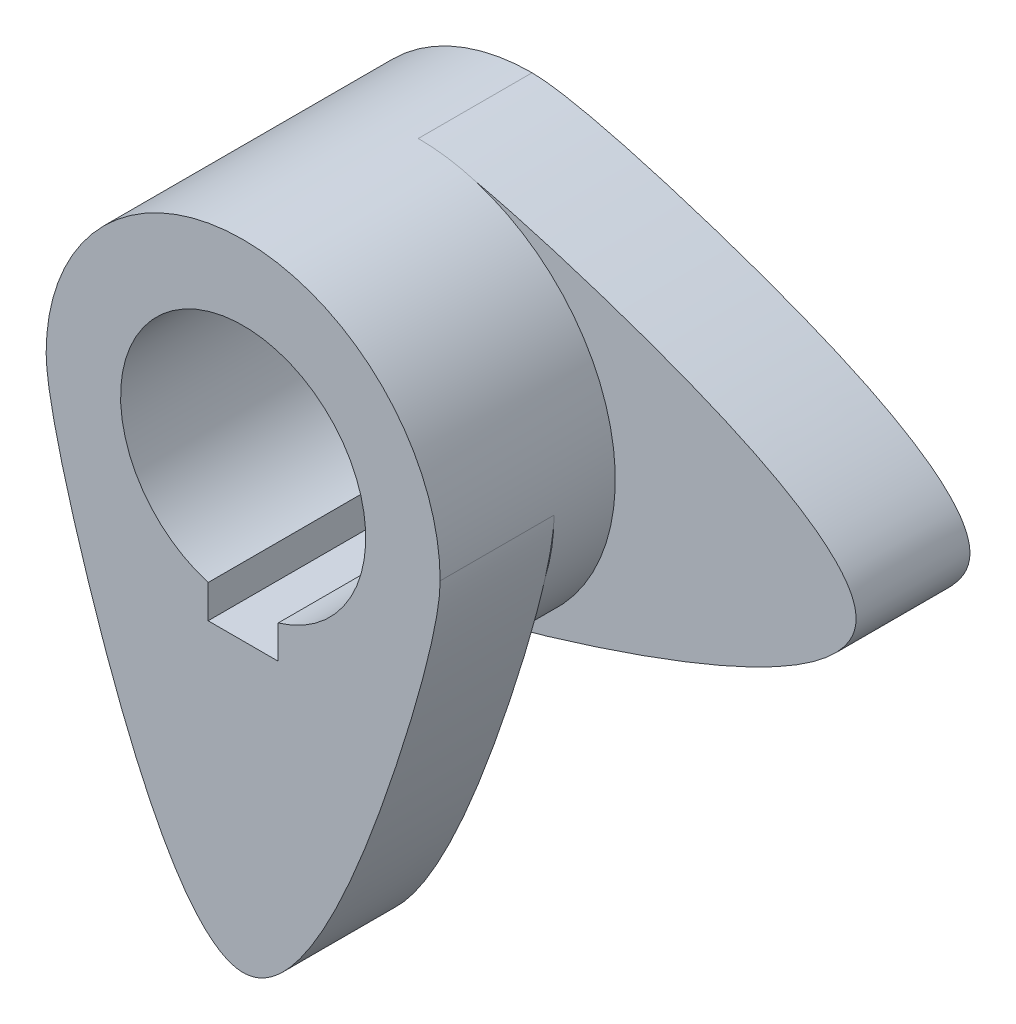
ISO-10303-21;
HEADER;
FILE_DESCRIPTION(('STEP AP214'),'2;1');
FILE_NAME('part.step','',(''),(''),'','','');
FILE_SCHEMA(('AUTOMOTIVE_DESIGN { 1 0 10303 214 1 1 1 1 }'));
ENDSEC;
DATA;
#1=APPLICATION_CONTEXT('core data for automotive mechanical design processes');
#2=APPLICATION_PROTOCOL_DEFINITION('international standard','automotive_design',2000,#1);
#3=PRODUCT_CONTEXT('',#1,'mechanical');
#4=PRODUCT('Part','Part','',(#3));
#5=PRODUCT_RELATED_PRODUCT_CATEGORY('part','',(#4));
#6=PRODUCT_DEFINITION_FORMATION('','',#4);
#7=PRODUCT_DEFINITION_CONTEXT('part definition',#1,'design');
#8=PRODUCT_DEFINITION('design','',#6,#7);
#9=PRODUCT_DEFINITION_SHAPE('','',#8);
#10=(LENGTH_UNIT() NAMED_UNIT(*) SI_UNIT(.MILLI.,.METRE.));
#11=(NAMED_UNIT(*) PLANE_ANGLE_UNIT() SI_UNIT($,.RADIAN.));
#12=(NAMED_UNIT(*) SI_UNIT($,.STERADIAN.) SOLID_ANGLE_UNIT());
#13=UNCERTAINTY_MEASURE_WITH_UNIT(LENGTH_MEASURE(1.E-05),#10,'distance_accuracy_value','');
#14=(GEOMETRIC_REPRESENTATION_CONTEXT(3) GLOBAL_UNCERTAINTY_ASSIGNED_CONTEXT((#13)) GLOBAL_UNIT_ASSIGNED_CONTEXT((#10,
#11,#12)) REPRESENTATION_CONTEXT('',''));
#15=CARTESIAN_POINT('',(0.,0.,0.));
#16=DIRECTION('',(0.,0.,1.));
#17=DIRECTION('',(1.,0.,0.));
#18=AXIS2_PLACEMENT_3D('',#15,#16,#17);
#19=CARTESIAN_POINT('',(0.,0.,20.));
#20=DIRECTION('',(0.,0.,1.));
#21=DIRECTION('',(1.,0.,0.));
#22=AXIS2_PLACEMENT_3D('',#19,#20,#21);
#23=PLANE('',#22);
#24=CARTESIAN_POINT('',(-22.5,0.,20.));
#25=CARTESIAN_POINT('',(-22.5,-3.73834670940359,20.));
#26=CARTESIAN_POINT('',(-16.9441205989671,-25.1550257614022,20.));
#27=CARTESIAN_POINT('',(-1.87295925296871E-13,-65.2956829567363,20.));
#28=CARTESIAN_POINT('',(16.9441205989668,-25.1520084052142,20.));
#29=CARTESIAN_POINT('',(22.5,-3.74256311968445,20.));
#30=CARTESIAN_POINT('',(22.5,0.,20.));
#31=B_SPLINE_CURVE_WITH_KNOTS('',3,(#24,#25,#26,#27,#28,#29,#30),.UNSPECIFIED.,.F.,.F.,(4,1,1,1,
4),(0.,0.192196215294909,0.5,0.807803784705092,1.),.UNSPECIFIED.);
#32=CARTESIAN_POINT('',(-22.5,0.,20.));
#33=VERTEX_POINT('',#32);
#34=CARTESIAN_POINT('',(-21.5382488581181,-6.50798249273717,20.));
#35=VERTEX_POINT('',#34);
#36=EDGE_CURVE('E150',#33,#35,#31,.T.);
#37=ORIENTED_EDGE('',*,*,#36,.F.);
#38=CARTESIAN_POINT('',(0.,0.,20.));
#39=DIRECTION('',(0.,0.,1.));
#40=DIRECTION('',(1.,0.,0.));
#41=AXIS2_PLACEMENT_3D('',#38,#39,#40);
#42=CIRCLE('',#41,22.5);
#43=EDGE_CURVE('E197',#33,#35,#42,.T.);
#44=ORIENTED_EDGE('',*,*,#43,.T.);
#45=EDGE_LOOP('',(#37,#44));
#46=FACE_BOUND('',#45,.T.);
#47=ADVANCED_FACE('F34',(#46),#23,.T.);
#48=CARTESIAN_POINT('',(50.,0.,13.));
#49=DIRECTION('',(0.,0.,1.));
#50=DIRECTION('',(1.,0.,0.));
#51=AXIS2_PLACEMENT_3D('',#48,#49,#50);
#52=PLANE('',#51);
#53=CARTESIAN_POINT('',(0.,0.,13.));
#54=DIRECTION('',(0.,0.,1.));
#55=DIRECTION('',(1.,0.,0.));
#56=AXIS2_PLACEMENT_3D('',#53,#54,#55);
#57=CIRCLE('',#56,22.5);
#58=CARTESIAN_POINT('',(6.50798249273742,-21.538248858118,13.));
#59=VERTEX_POINT('',#58);
#60=CARTESIAN_POINT('',(6.50166190853766,21.5401576695035,13.));
#61=VERTEX_POINT('',#60);
#62=EDGE_CURVE('E233',#59,#61,#57,.T.);
#63=ORIENTED_EDGE('',*,*,#62,.F.);
#64=CARTESIAN_POINT('',(0.,-22.5,13.));
#65=CARTESIAN_POINT('',(3.73834670940365,-22.5,13.));
#66=CARTESIAN_POINT('',(25.1550257614023,-16.944120598967,13.));
#67=CARTESIAN_POINT('',(65.2956829567362,0.,13.));
#68=CARTESIAN_POINT('',(25.1520084052142,16.944120598967,13.));
#69=CARTESIAN_POINT('',(3.74256311968439,22.5,13.));
#70=CARTESIAN_POINT('',(0.,22.5,13.));
#71=B_SPLINE_CURVE_WITH_KNOTS('',3,(#64,#65,#66,#67,#68,#69,#70),.UNSPECIFIED.,.F.,.F.,(4,1,1,1,
4),(0.,0.192196215294909,0.5,0.807803784705091,1.),.UNSPECIFIED.);
#72=EDGE_CURVE('E251',#59,#61,#71,.T.);
#73=ORIENTED_EDGE('',*,*,#72,.T.);
#74=EDGE_LOOP('',(#63,#73));
#75=FACE_BOUND('',#74,.T.);
#76=ADVANCED_FACE('F176',(#75),#52,.T.);
#77=CARTESIAN_POINT('',(50.,0.,0.));
#78=DIRECTION('',(0.,0.,1.));
#79=DIRECTION('',(1.,0.,0.));
#80=AXIS2_PLACEMENT_3D('',#77,#78,#79);
#81=PLANE('',#80);
#82=CARTESIAN_POINT('',(0.,-22.5,0.));
#83=CARTESIAN_POINT('',(3.73834670940365,-22.5,0.));
#84=CARTESIAN_POINT('',(25.1550257614023,-16.944120598967,0.));
#85=CARTESIAN_POINT('',(65.2956829567362,0.,0.));
#86=CARTESIAN_POINT('',(25.1520084052142,16.944120598967,0.));
#87=CARTESIAN_POINT('',(3.74256311968439,22.5,0.));
#88=CARTESIAN_POINT('',(0.,22.5,0.));
#89=B_SPLINE_CURVE_WITH_KNOTS('',3,(#82,#83,#84,#85,#86,#87,#88),.UNSPECIFIED.,.F.,.F.,(4,1,1,1,
4),(0.,0.192196215294909,0.5,0.807803784705091,1.),.UNSPECIFIED.);
#90=CARTESIAN_POINT('',(0.,-22.5,0.));
#91=VERTEX_POINT('',#90);
#92=CARTESIAN_POINT('',(0.,22.5,0.));
#93=VERTEX_POINT('',#92);
#94=EDGE_CURVE('E260',#91,#93,#89,.T.);
#95=ORIENTED_EDGE('',*,*,#94,.F.);
#96=CARTESIAN_POINT('',(0.,0.,0.));
#97=DIRECTION('',(0.,0.,1.));
#98=DIRECTION('',(1.,0.,0.));
#99=AXIS2_PLACEMENT_3D('',#96,#97,#98);
#100=CIRCLE('',#99,22.5);
#101=EDGE_CURVE('E252',#93,#91,#100,.T.);
#102=ORIENTED_EDGE('',*,*,#101,.F.);
#103=EDGE_LOOP('',(#95,#102));
#104=FACE_BOUND('',#103,.T.);
#105=DIRECTION('',(1.,0.,0.));
#106=VECTOR('',#105,1.);
#107=CARTESIAN_POINT('',(50.,-17.2,0.));
#108=LINE('',#107,#106);
#109=CARTESIAN_POINT('',(-4.,-17.2,0.));
#110=VERTEX_POINT('',#109);
#111=CARTESIAN_POINT('',(4.,-17.2,0.));
#112=VERTEX_POINT('',#111);
#113=EDGE_CURVE('E118',#110,#112,#108,.T.);
#114=ORIENTED_EDGE('',*,*,#113,.T.);
#115=DIRECTION('',(0.,1.,0.));
#116=VECTOR('',#115,1.);
#117=CARTESIAN_POINT('',(4.,0.,0.));
#118=LINE('',#117,#116);
#119=CARTESIAN_POINT('',(4.,-13.4164078649987,0.));
#120=VERTEX_POINT('',#119);
#121=EDGE_CURVE('E139',#112,#120,#118,.T.);
#122=ORIENTED_EDGE('',*,*,#121,.T.);
#123=CARTESIAN_POINT('',(0.,0.,0.));
#124=DIRECTION('',(0.,0.,1.));
#125=DIRECTION('',(1.,0.,0.));
#126=AXIS2_PLACEMENT_3D('',#123,#124,#125);
#127=CIRCLE('',#126,14.);
#128=CARTESIAN_POINT('',(-4.,-13.4164078649987,0.));
#129=VERTEX_POINT('',#128);
#130=EDGE_CURVE('E208',#120,#129,#127,.T.);
#131=ORIENTED_EDGE('',*,*,#130,.T.);
#132=DIRECTION('',(0.,-1.,0.));
#133=VECTOR('',#132,1.);
#134=CARTESIAN_POINT('',(-4.,0.,0.));
#135=LINE('',#134,#133);
#136=EDGE_CURVE('E134',#129,#110,#135,.T.);
#137=ORIENTED_EDGE('',*,*,#136,.T.);
#138=EDGE_LOOP('',(#114,#122,#131,#137));
#139=FACE_BOUND('',#138,.T.);
#140=ADVANCED_FACE('F179',(#104,#139),#81,.F.);
#141=DIRECTION('',(0.,0.,-1.));
#142=VECTOR('',#141,1.);
#143=SURFACE_OF_LINEAR_EXTRUSION('',#71,#142);
#144=ORIENTED_EDGE('',*,*,#94,.T.);
#145=DIRECTION('',(0.,0.,-1.));
#146=VECTOR('',#145,1.);
#147=CARTESIAN_POINT('',(0.,22.5,13.));
#148=LINE('',#147,#146);
#149=CARTESIAN_POINT('',(0.,22.5,13.));
#150=VERTEX_POINT('',#149);
#151=EDGE_CURVE('E244',#150,#93,#148,.T.);
#152=ORIENTED_EDGE('',*,*,#151,.F.);
#153=EDGE_CURVE('E248',#61,#150,#71,.T.);
#154=ORIENTED_EDGE('',*,*,#153,.F.);
#155=ORIENTED_EDGE('',*,*,#72,.F.);
#156=CARTESIAN_POINT('',(0.,-22.5,13.));
#157=VERTEX_POINT('',#156);
#158=EDGE_CURVE('E253',#157,#59,#71,.T.);
#159=ORIENTED_EDGE('',*,*,#158,.F.);
#160=DIRECTION('',(0.,0.,-1.));
#161=VECTOR('',#160,1.);
#162=CARTESIAN_POINT('',(0.,-22.5,13.));
#163=LINE('',#162,#161);
#164=EDGE_CURVE('E247',#157,#91,#163,.T.);
#165=ORIENTED_EDGE('',*,*,#164,.T.);
#166=EDGE_LOOP('',(#144,#152,#154,#155,#159,#165));
#167=FACE_BOUND('',#166,.T.);
#168=ADVANCED_FACE('F36',(#167),#143,.F.);
#169=CARTESIAN_POINT('',(0.,0.,13.));
#170=DIRECTION('',(0.,0.,-1.));
#171=DIRECTION('',(-1.,0.,0.));
#172=AXIS2_PLACEMENT_3D('',#169,#170,#171);
#173=CYLINDRICAL_SURFACE('',#172,22.5);
#174=ORIENTED_EDGE('',*,*,#101,.T.);
#175=ORIENTED_EDGE('',*,*,#164,.F.);
#176=EDGE_CURVE('E214',#157,#59,#57,.T.);
#177=ORIENTED_EDGE('',*,*,#176,.T.);
#178=ORIENTED_EDGE('',*,*,#62,.T.);
#179=EDGE_CURVE('E224',#61,#150,#57,.T.);
#180=ORIENTED_EDGE('',*,*,#179,.T.);
#181=ORIENTED_EDGE('',*,*,#151,.T.);
#182=EDGE_LOOP('',(#174,#175,#177,#178,#180,#181));
#183=FACE_BOUND('',#182,.T.);
#184=ORIENTED_EDGE('',*,*,#43,.F.);
#185=DIRECTION('',(0.,0.,-1.));
#186=VECTOR('',#185,1.);
#187=CARTESIAN_POINT('',(-22.5,0.,33.));
#188=LINE('',#187,#186);
#189=CARTESIAN_POINT('',(-22.5,0.,33.));
#190=VERTEX_POINT('',#189);
#191=EDGE_CURVE('E204',#190,#33,#188,.T.);
#192=ORIENTED_EDGE('',*,*,#191,.F.);
#193=CARTESIAN_POINT('',(0.,0.,33.));
#194=DIRECTION('',(0.,0.,1.));
#195=DIRECTION('',(1.,0.,0.));
#196=AXIS2_PLACEMENT_3D('',#193,#194,#195);
#197=CIRCLE('',#196,22.5);
#198=CARTESIAN_POINT('',(22.5,0.,33.));
#199=VERTEX_POINT('',#198);
#200=EDGE_CURVE('E149',#199,#190,#197,.T.);
#201=ORIENTED_EDGE('',*,*,#200,.F.);
#202=DIRECTION('',(0.,0.,-1.));
#203=VECTOR('',#202,1.);
#204=CARTESIAN_POINT('',(22.5,0.,33.));
#205=LINE('',#204,#203);
#206=CARTESIAN_POINT('',(22.5,0.,20.));
#207=VERTEX_POINT('',#206);
#208=EDGE_CURVE('E211',#199,#207,#205,.T.);
#209=ORIENTED_EDGE('',*,*,#208,.T.);
#210=CARTESIAN_POINT('',(21.5401576695034,-6.50166190853786,20.));
#211=VERTEX_POINT('',#210);
#212=EDGE_CURVE('E234',#211,#207,#42,.T.);
#213=ORIENTED_EDGE('',*,*,#212,.F.);
#214=EDGE_CURVE('E207',#35,#211,#42,.T.);
#215=ORIENTED_EDGE('',*,*,#214,.F.);
#216=EDGE_LOOP('',(#184,#192,#201,#209,#213,#215));
#217=FACE_BOUND('',#216,.T.);
#218=ADVANCED_FACE('F174',(#183,#217),#173,.T.);
#219=CARTESIAN_POINT('',(0.,0.,13.));
#220=DIRECTION('',(0.,0.,-1.));
#221=DIRECTION('',(-1.,0.,0.));
#222=AXIS2_PLACEMENT_3D('',#219,#220,#221);
#223=CYLINDRICAL_SURFACE('',#222,14.);
#224=DIRECTION('',(0.,0.,-1.));
#225=VECTOR('',#224,1.);
#226=CARTESIAN_POINT('',(4.,-13.4164078649987,13.));
#227=LINE('',#226,#225);
#228=CARTESIAN_POINT('',(4.,-13.4164078649987,33.));
#229=VERTEX_POINT('',#228);
#230=EDGE_CURVE('E137',#229,#120,#227,.T.);
#231=ORIENTED_EDGE('',*,*,#230,.F.);
#232=CARTESIAN_POINT('',(0.,0.,33.));
#233=DIRECTION('',(0.,0.,1.));
#234=DIRECTION('',(1.,0.,0.));
#235=AXIS2_PLACEMENT_3D('',#232,#233,#234);
#236=CIRCLE('',#235,14.);
#237=CARTESIAN_POINT('',(-4.,-13.4164078649987,33.));
#238=VERTEX_POINT('',#237);
#239=EDGE_CURVE('E142',#229,#238,#236,.T.);
#240=ORIENTED_EDGE('',*,*,#239,.T.);
#241=DIRECTION('',(0.,0.,-1.));
#242=VECTOR('',#241,1.);
#243=CARTESIAN_POINT('',(-4.,-13.4164078649987,13.));
#244=LINE('',#243,#242);
#245=EDGE_CURVE('E49',#129,#238,#244,.F.);
#246=ORIENTED_EDGE('',*,*,#245,.F.);
#247=ORIENTED_EDGE('',*,*,#130,.F.);
#248=EDGE_LOOP('',(#231,#240,#246,#247));
#249=FACE_BOUND('',#248,.T.);
#250=ADVANCED_FACE('F167',(#249),#223,.F.);
#251=EDGE_CURVE('E43',#211,#207,#31,.T.);
#252=ORIENTED_EDGE('',*,*,#251,.F.);
#253=ORIENTED_EDGE('',*,*,#212,.T.);
#254=EDGE_LOOP('',(#252,#253));
#255=FACE_BOUND('',#254,.T.);
#256=ADVANCED_FACE('F163',(#255),#23,.T.);
#257=CARTESIAN_POINT('',(0.,0.,13.));
#258=DIRECTION('',(0.,0.,1.));
#259=DIRECTION('',(1.,0.,0.));
#260=AXIS2_PLACEMENT_3D('',#257,#258,#259);
#261=PLANE('',#260);
#262=ORIENTED_EDGE('',*,*,#179,.F.);
#263=ORIENTED_EDGE('',*,*,#153,.T.);
#264=EDGE_LOOP('',(#262,#263));
#265=FACE_BOUND('',#264,.T.);
#266=ADVANCED_FACE('F166',(#265),#261,.F.);
#267=ORIENTED_EDGE('',*,*,#176,.F.);
#268=ORIENTED_EDGE('',*,*,#158,.T.);
#269=EDGE_LOOP('',(#267,#268));
#270=FACE_BOUND('',#269,.T.);
#271=ADVANCED_FACE('F168',(#270),#261,.F.);
#272=CARTESIAN_POINT('',(-1.81141937005741E-13,-50.,20.));
#273=DIRECTION('',(0.,0.,1.));
#274=DIRECTION('',(1.,0.,0.));
#275=AXIS2_PLACEMENT_3D('',#272,#273,#274);
#276=PLANE('',#275);
#277=EDGE_CURVE('E201',#35,#211,#31,.T.);
#278=ORIENTED_EDGE('',*,*,#277,.F.);
#279=ORIENTED_EDGE('',*,*,#214,.T.);
#280=EDGE_LOOP('',(#278,#279));
#281=FACE_BOUND('',#280,.T.);
#282=ADVANCED_FACE('F160',(#281),#276,.F.);
#283=CARTESIAN_POINT('',(-22.5,0.,33.));
#284=CARTESIAN_POINT('',(-22.5,-3.73834670940359,33.));
#285=CARTESIAN_POINT('',(-16.9441205989671,-25.1550257614022,33.));
#286=CARTESIAN_POINT('',(-1.87295925296871E-13,-65.2956829567363,33.));
#287=CARTESIAN_POINT('',(16.9441205989668,-25.1520084052142,33.));
#288=CARTESIAN_POINT('',(22.5,-3.74256311968445,33.));
#289=CARTESIAN_POINT('',(22.5,0.,33.));
#290=B_SPLINE_CURVE_WITH_KNOTS('',3,(#283,#284,#285,#286,#287,#288,#289),.UNSPECIFIED.,.F.,.F.,
(4,1,1,1,4),(0.,0.192196215294909,0.5,0.807803784705092,1.),.UNSPECIFIED.);
#291=DIRECTION('',(0.,0.,-1.));
#292=VECTOR('',#291,1.);
#293=SURFACE_OF_LINEAR_EXTRUSION('',#290,#292);
#294=ORIENTED_EDGE('',*,*,#36,.T.);
#295=ORIENTED_EDGE('',*,*,#277,.T.);
#296=ORIENTED_EDGE('',*,*,#251,.T.);
#297=ORIENTED_EDGE('',*,*,#208,.F.);
#298=EDGE_CURVE('E143',#190,#199,#290,.T.);
#299=ORIENTED_EDGE('',*,*,#298,.F.);
#300=ORIENTED_EDGE('',*,*,#191,.T.);
#301=EDGE_LOOP('',(#294,#295,#296,#297,#299,#300));
#302=FACE_BOUND('',#301,.T.);
#303=ADVANCED_FACE('F156',(#302),#293,.F.);
#304=CARTESIAN_POINT('',(-1.81141937005741E-13,-50.,33.));
#305=DIRECTION('',(0.,0.,1.));
#306=DIRECTION('',(1.,0.,0.));
#307=AXIS2_PLACEMENT_3D('',#304,#305,#306);
#308=PLANE('',#307);
#309=DIRECTION('',(0.,1.,0.));
#310=VECTOR('',#309,1.);
#311=CARTESIAN_POINT('',(4.,-14.,33.));
#312=LINE('',#311,#310);
#313=CARTESIAN_POINT('',(4.,-17.2,33.));
#314=VERTEX_POINT('',#313);
#315=EDGE_CURVE('E121',#314,#229,#312,.T.);
#316=ORIENTED_EDGE('',*,*,#315,.F.);
#317=DIRECTION('',(1.,0.,0.));
#318=VECTOR('',#317,1.);
#319=CARTESIAN_POINT('',(4.,-17.2,33.));
#320=LINE('',#319,#318);
#321=CARTESIAN_POINT('',(-4.,-17.2,33.));
#322=VERTEX_POINT('',#321);
#323=EDGE_CURVE('E115',#322,#314,#320,.T.);
#324=ORIENTED_EDGE('',*,*,#323,.F.);
#325=DIRECTION('',(0.,-1.,0.));
#326=VECTOR('',#325,1.);
#327=CARTESIAN_POINT('',(-3.99999999999999,-50.,33.));
#328=LINE('',#327,#326);
#329=EDGE_CURVE('E11',#238,#322,#328,.T.);
#330=ORIENTED_EDGE('',*,*,#329,.F.);
#331=ORIENTED_EDGE('',*,*,#239,.F.);
#332=EDGE_LOOP('',(#316,#324,#330,#331));
#333=FACE_BOUND('',#332,.T.);
#334=ORIENTED_EDGE('',*,*,#298,.T.);
#335=ORIENTED_EDGE('',*,*,#200,.T.);
#336=EDGE_LOOP('',(#334,#335));
#337=FACE_BOUND('',#336,.T.);
#338=ADVANCED_FACE('F127',(#333,#337),#308,.T.);
#339=CARTESIAN_POINT('',(4.,-14.,-7.99999999999999));
#340=DIRECTION('',(1.,0.,0.));
#341=DIRECTION('',(0.,0.,-1.));
#342=AXIS2_PLACEMENT_3D('',#339,#340,#341);
#343=PLANE('',#342);
#344=DIRECTION('',(0.,0.,1.));
#345=VECTOR('',#344,1.);
#346=CARTESIAN_POINT('',(4.,-17.2,-7.99999999999999));
#347=LINE('',#346,#345);
#348=EDGE_CURVE('E120',#112,#314,#347,.T.);
#349=ORIENTED_EDGE('',*,*,#348,.T.);
#350=ORIENTED_EDGE('',*,*,#315,.T.);
#351=ORIENTED_EDGE('',*,*,#230,.T.);
#352=ORIENTED_EDGE('',*,*,#121,.F.);
#353=EDGE_LOOP('',(#349,#350,#351,#352));
#354=FACE_BOUND('',#353,.T.);
#355=ADVANCED_FACE('F292',(#354),#343,.F.);
#356=CARTESIAN_POINT('',(4.,-17.2,-7.99999999999999));
#357=DIRECTION('',(0.,-1.,0.));
#358=DIRECTION('',(1.,0.,0.));
#359=AXIS2_PLACEMENT_3D('',#356,#357,#358);
#360=PLANE('',#359);
#361=DIRECTION('',(0.,0.,1.));
#362=VECTOR('',#361,1.);
#363=CARTESIAN_POINT('',(-4.,-17.2,-7.99999999999999));
#364=LINE('',#363,#362);
#365=EDGE_CURVE('E111',#110,#322,#364,.T.);
#366=ORIENTED_EDGE('',*,*,#365,.T.);
#367=ORIENTED_EDGE('',*,*,#323,.T.);
#368=ORIENTED_EDGE('',*,*,#348,.F.);
#369=ORIENTED_EDGE('',*,*,#113,.F.);
#370=EDGE_LOOP('',(#366,#367,#368,#369));
#371=FACE_BOUND('',#370,.T.);
#372=ADVANCED_FACE('F112',(#371),#360,.F.);
#373=CARTESIAN_POINT('',(-4.,-14.,-7.99999999999999));
#374=DIRECTION('',(-1.,0.,0.));
#375=DIRECTION('',(0.,-1.,0.));
#376=AXIS2_PLACEMENT_3D('',#373,#374,#375);
#377=PLANE('',#376);
#378=ORIENTED_EDGE('',*,*,#245,.T.);
#379=ORIENTED_EDGE('',*,*,#329,.T.);
#380=ORIENTED_EDGE('',*,*,#365,.F.);
#381=ORIENTED_EDGE('',*,*,#136,.F.);
#382=EDGE_LOOP('',(#378,#379,#380,#381));
#383=FACE_BOUND('',#382,.T.);
#384=ADVANCED_FACE('F123',(#383),#377,.F.);
#385=CLOSED_SHELL('',(#47,#76,#140,#168,#218,#250,#256,#266,#271,#282,#303,#338,#355,#372,#384));
#386=MANIFOLD_SOLID_BREP('B2',#385);
#387=ADVANCED_BREP_SHAPE_REPRESENTATION('',(#18,#386),#14);
#388=SHAPE_DEFINITION_REPRESENTATION(#9,#387);
ENDSEC;
END-ISO-10303-21;
